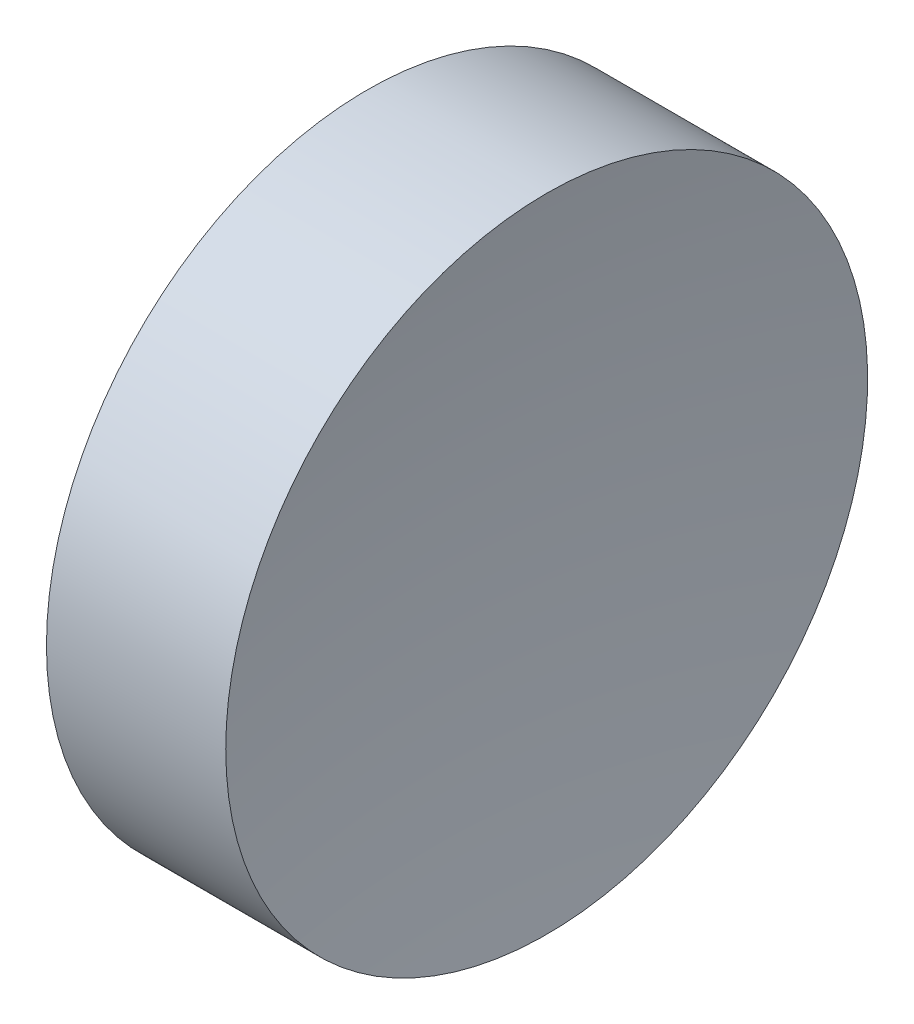
ISO-10303-21;
HEADER;
FILE_DESCRIPTION(('STEP AP214'),'2;1');
FILE_NAME('part.step','',(''),(''),'','','');
FILE_SCHEMA(('AUTOMOTIVE_DESIGN { 1 0 10303 214 1 1 1 1 }'));
ENDSEC;
DATA;
#1=APPLICATION_CONTEXT('core data for automotive mechanical design processes');
#2=APPLICATION_PROTOCOL_DEFINITION('international standard','automotive_design',2000,#1);
#3=PRODUCT_CONTEXT('',#1,'mechanical');
#4=PRODUCT('Part','Part','',(#3));
#5=PRODUCT_RELATED_PRODUCT_CATEGORY('part','',(#4));
#6=PRODUCT_DEFINITION_FORMATION('','',#4);
#7=PRODUCT_DEFINITION_CONTEXT('part definition',#1,'design');
#8=PRODUCT_DEFINITION('design','',#6,#7);
#9=PRODUCT_DEFINITION_SHAPE('','',#8);
#10=(LENGTH_UNIT() NAMED_UNIT(*) SI_UNIT(.MILLI.,.METRE.));
#11=(NAMED_UNIT(*) PLANE_ANGLE_UNIT() SI_UNIT($,.RADIAN.));
#12=(NAMED_UNIT(*) SI_UNIT($,.STERADIAN.) SOLID_ANGLE_UNIT());
#13=UNCERTAINTY_MEASURE_WITH_UNIT(LENGTH_MEASURE(1.E-05),#10,'distance_accuracy_value','');
#14=(GEOMETRIC_REPRESENTATION_CONTEXT(3) GLOBAL_UNCERTAINTY_ASSIGNED_CONTEXT((#13)) GLOBAL_UNIT_ASSIGNED_CONTEXT((#10,
#11,#12)) REPRESENTATION_CONTEXT('',''));
#15=CARTESIAN_POINT('',(0.,0.,0.));
#16=DIRECTION('',(0.,0.,1.));
#17=DIRECTION('',(1.,0.,0.));
#18=AXIS2_PLACEMENT_3D('',#15,#16,#17);
#19=CARTESIAN_POINT('',(100.546327768837,34.6890105616862,0.));
#20=DIRECTION('',(-1.,0.,0.));
#21=DIRECTION('',(0.,1.,0.));
#22=AXIS2_PLACEMENT_3D('',#19,#20,#21);
#23=SPHERICAL_SURFACE('',#22,40.);
#24=CARTESIAN_POINT('',(61.037626195639,34.6890105616862,0.));
#25=DIRECTION('',(-1.,0.,0.));
#26=DIRECTION('',(0.,0.,1.));
#27=AXIS2_PLACEMENT_3D('',#24,#25,#26);
#28=CIRCLE('',#27,6.25000000000001);
#29=CARTESIAN_POINT('',(61.037626195639,34.6890105616862,6.25000000000001));
#30=VERTEX_POINT('',#29);
#31=EDGE_CURVE('E10',#30,#30,#28,.T.);
#32=ORIENTED_EDGE('',*,*,#31,.F.);
#33=EDGE_LOOP('',(#32));
#34=FACE_BOUND('',#33,.T.);
#35=ADVANCED_FACE('F35',(#34),#23,.F.);
#36=CARTESIAN_POINT('',(54.4925715010826,34.6890105616862,0.));
#37=DIRECTION('',(-1.,0.,0.));
#38=DIRECTION('',(0.,0.,1.));
#39=AXIS2_PLACEMENT_3D('',#36,#37,#38);
#40=CYLINDRICAL_SURFACE('',#39,6.25);
#41=CARTESIAN_POINT('',(57.5463277674598,34.6890105616862,0.));
#42=DIRECTION('',(-1.,0.,0.));
#43=DIRECTION('',(0.,0.,1.));
#44=AXIS2_PLACEMENT_3D('',#41,#42,#43);
#45=CIRCLE('',#44,6.25);
#46=CARTESIAN_POINT('',(57.5463277674598,34.6890105616862,6.25));
#47=VERTEX_POINT('',#46);
#48=EDGE_CURVE('E41',#47,#47,#45,.T.);
#49=ORIENTED_EDGE('',*,*,#48,.F.);
#50=EDGE_LOOP('',(#49));
#51=FACE_BOUND('',#50,.T.);
#52=ORIENTED_EDGE('',*,*,#31,.T.);
#53=EDGE_LOOP('',(#52));
#54=FACE_BOUND('',#53,.T.);
#55=ADVANCED_FACE('F49',(#51,#54),#40,.T.);
#56=CARTESIAN_POINT('',(57.5463277674598,34.6890105616862,0.));
#57=DIRECTION('',(1.,0.,0.));
#58=DIRECTION('',(0.,0.,-1.));
#59=AXIS2_PLACEMENT_3D('',#56,#57,#58);
#60=PLANE('',#59);
#61=ORIENTED_EDGE('',*,*,#48,.T.);
#62=EDGE_LOOP('',(#61));
#63=FACE_BOUND('',#62,.T.);
#64=ADVANCED_FACE('F47',(#63),#60,.F.);
#65=CLOSED_SHELL('',(#35,#55,#64));
#66=MANIFOLD_SOLID_BREP('B2',#65);
#67=ADVANCED_BREP_SHAPE_REPRESENTATION('',(#18,#66),#14);
#68=SHAPE_DEFINITION_REPRESENTATION(#9,#67);
ENDSEC;
END-ISO-10303-21;
